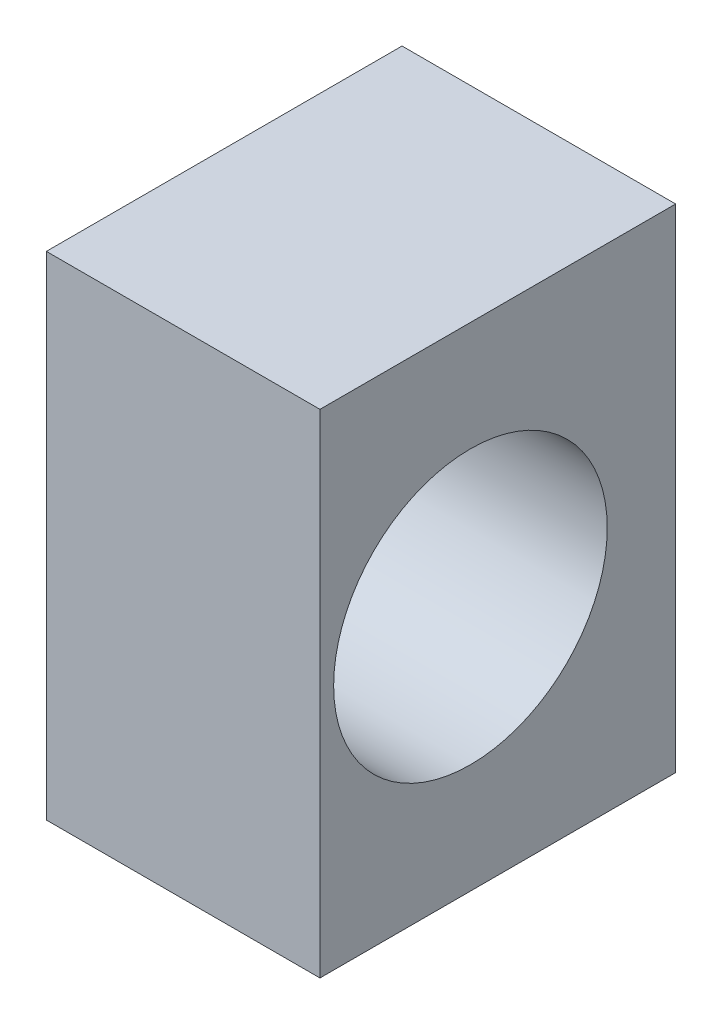
ISO-10303-21;
HEADER;
FILE_DESCRIPTION(('STEP AP214'),'2;1');
FILE_NAME('part.step','',(''),(''),'','','');
FILE_SCHEMA(('AUTOMOTIVE_DESIGN { 1 0 10303 214 1 1 1 1 }'));
ENDSEC;
DATA;
#1=APPLICATION_CONTEXT('core data for automotive mechanical design processes');
#2=APPLICATION_PROTOCOL_DEFINITION('international standard','automotive_design',2000,#1);
#3=PRODUCT_CONTEXT('',#1,'mechanical');
#4=PRODUCT('Part','Part','',(#3));
#5=PRODUCT_RELATED_PRODUCT_CATEGORY('part','',(#4));
#6=PRODUCT_DEFINITION_FORMATION('','',#4);
#7=PRODUCT_DEFINITION_CONTEXT('part definition',#1,'design');
#8=PRODUCT_DEFINITION('design','',#6,#7);
#9=PRODUCT_DEFINITION_SHAPE('','',#8);
#10=(LENGTH_UNIT() NAMED_UNIT(*) SI_UNIT(.MILLI.,.METRE.));
#11=(NAMED_UNIT(*) PLANE_ANGLE_UNIT() SI_UNIT($,.RADIAN.));
#12=(NAMED_UNIT(*) SI_UNIT($,.STERADIAN.) SOLID_ANGLE_UNIT());
#13=UNCERTAINTY_MEASURE_WITH_UNIT(LENGTH_MEASURE(1.E-05),#10,'distance_accuracy_value','');
#14=(GEOMETRIC_REPRESENTATION_CONTEXT(3) GLOBAL_UNCERTAINTY_ASSIGNED_CONTEXT((#13)) GLOBAL_UNIT_ASSIGNED_CONTEXT((#10,
#11,#12)) REPRESENTATION_CONTEXT('',''));
#15=CARTESIAN_POINT('',(0.,0.,0.));
#16=DIRECTION('',(0.,0.,1.));
#17=DIRECTION('',(1.,0.,0.));
#18=AXIS2_PLACEMENT_3D('',#15,#16,#17);
#19=CARTESIAN_POINT('',(10.,0.,0.));
#20=DIRECTION('',(0.,0.,-1.));
#21=DIRECTION('',(0.,1.,0.));
#22=AXIS2_PLACEMENT_3D('',#19,#20,#21);
#23=PLANE('',#22);
#24=DIRECTION('',(0.,-1.,0.));
#25=VECTOR('',#24,1.);
#26=CARTESIAN_POINT('',(0.,0.,0.));
#27=LINE('',#26,#25);
#28=CARTESIAN_POINT('',(0.,18.,0.));
#29=VERTEX_POINT('',#28);
#30=CARTESIAN_POINT('',(0.,0.,0.));
#31=VERTEX_POINT('',#30);
#32=EDGE_CURVE('E94',#29,#31,#27,.T.);
#33=ORIENTED_EDGE('',*,*,#32,.T.);
#34=DIRECTION('',(-1.,0.,0.));
#35=VECTOR('',#34,1.);
#36=CARTESIAN_POINT('',(10.,0.,0.));
#37=LINE('',#36,#35);
#38=CARTESIAN_POINT('',(10.,0.,0.));
#39=VERTEX_POINT('',#38);
#40=EDGE_CURVE('E11',#39,#31,#37,.T.);
#41=ORIENTED_EDGE('',*,*,#40,.F.);
#42=DIRECTION('',(0.,-1.,0.));
#43=VECTOR('',#42,1.);
#44=CARTESIAN_POINT('',(10.,0.,0.));
#45=LINE('',#44,#43);
#46=CARTESIAN_POINT('',(10.,18.,0.));
#47=VERTEX_POINT('',#46);
#48=EDGE_CURVE('E82',#47,#39,#45,.T.);
#49=ORIENTED_EDGE('',*,*,#48,.F.);
#50=DIRECTION('',(-1.,0.,0.));
#51=VECTOR('',#50,1.);
#52=CARTESIAN_POINT('',(10.,18.,0.));
#53=LINE('',#52,#51);
#54=EDGE_CURVE('E90',#47,#29,#53,.T.);
#55=ORIENTED_EDGE('',*,*,#54,.T.);
#56=EDGE_LOOP('',(#33,#41,#49,#55));
#57=FACE_BOUND('',#56,.T.);
#58=ADVANCED_FACE('F31',(#57),#23,.F.);
#59=CARTESIAN_POINT('',(10.,0.,0.));
#60=DIRECTION('',(0.,1.,0.));
#61=DIRECTION('',(0.,0.,1.));
#62=AXIS2_PLACEMENT_3D('',#59,#60,#61);
#63=PLANE('',#62);
#64=DIRECTION('',(0.,0.,-1.));
#65=VECTOR('',#64,1.);
#66=CARTESIAN_POINT('',(0.,0.,0.));
#67=LINE('',#66,#65);
#68=CARTESIAN_POINT('',(0.,0.,-13.));
#69=VERTEX_POINT('',#68);
#70=EDGE_CURVE('E86',#31,#69,#67,.T.);
#71=ORIENTED_EDGE('',*,*,#70,.T.);
#72=DIRECTION('',(-1.,0.,0.));
#73=VECTOR('',#72,1.);
#74=CARTESIAN_POINT('',(10.,0.,-13.));
#75=LINE('',#74,#73);
#76=CARTESIAN_POINT('',(10.,0.,-13.));
#77=VERTEX_POINT('',#76);
#78=EDGE_CURVE('E39',#77,#69,#75,.T.);
#79=ORIENTED_EDGE('',*,*,#78,.F.);
#80=DIRECTION('',(0.,0.,-1.));
#81=VECTOR('',#80,1.);
#82=CARTESIAN_POINT('',(10.,0.,0.));
#83=LINE('',#82,#81);
#84=EDGE_CURVE('E77',#39,#77,#83,.T.);
#85=ORIENTED_EDGE('',*,*,#84,.F.);
#86=ORIENTED_EDGE('',*,*,#40,.T.);
#87=EDGE_LOOP('',(#71,#79,#85,#86));
#88=FACE_BOUND('',#87,.T.);
#89=ADVANCED_FACE('F85',(#88),#63,.F.);
#90=CARTESIAN_POINT('',(10.,0.,-13.));
#91=DIRECTION('',(0.,0.,1.));
#92=DIRECTION('',(0.,-1.,0.));
#93=AXIS2_PLACEMENT_3D('',#90,#91,#92);
#94=PLANE('',#93);
#95=DIRECTION('',(0.,1.,0.));
#96=VECTOR('',#95,1.);
#97=CARTESIAN_POINT('',(0.,0.,-13.));
#98=LINE('',#97,#96);
#99=CARTESIAN_POINT('',(0.,18.,-13.));
#100=VERTEX_POINT('',#99);
#101=EDGE_CURVE('E64',#69,#100,#98,.T.);
#102=ORIENTED_EDGE('',*,*,#101,.T.);
#103=DIRECTION('',(-1.,0.,0.));
#104=VECTOR('',#103,1.);
#105=CARTESIAN_POINT('',(10.,18.,-13.));
#106=LINE('',#105,#104);
#107=CARTESIAN_POINT('',(10.,18.,-13.));
#108=VERTEX_POINT('',#107);
#109=EDGE_CURVE('E87',#108,#100,#106,.T.);
#110=ORIENTED_EDGE('',*,*,#109,.F.);
#111=DIRECTION('',(0.,1.,0.));
#112=VECTOR('',#111,1.);
#113=CARTESIAN_POINT('',(10.,0.,-13.));
#114=LINE('',#113,#112);
#115=EDGE_CURVE('E80',#77,#108,#114,.T.);
#116=ORIENTED_EDGE('',*,*,#115,.F.);
#117=ORIENTED_EDGE('',*,*,#78,.T.);
#118=EDGE_LOOP('',(#102,#110,#116,#117));
#119=FACE_BOUND('',#118,.T.);
#120=ADVANCED_FACE('F88',(#119),#94,.F.);
#121=CARTESIAN_POINT('',(10.,18.,0.));
#122=DIRECTION('',(0.,-1.,0.));
#123=DIRECTION('',(0.,0.,-1.));
#124=AXIS2_PLACEMENT_3D('',#121,#122,#123);
#125=PLANE('',#124);
#126=DIRECTION('',(0.,0.,1.));
#127=VECTOR('',#126,1.);
#128=CARTESIAN_POINT('',(0.,18.,0.));
#129=LINE('',#128,#127);
#130=EDGE_CURVE('E70',#100,#29,#129,.T.);
#131=ORIENTED_EDGE('',*,*,#130,.T.);
#132=ORIENTED_EDGE('',*,*,#54,.F.);
#133=DIRECTION('',(0.,0.,1.));
#134=VECTOR('',#133,1.);
#135=CARTESIAN_POINT('',(10.,18.,0.));
#136=LINE('',#135,#134);
#137=EDGE_CURVE('E47',#108,#47,#136,.T.);
#138=ORIENTED_EDGE('',*,*,#137,.F.);
#139=ORIENTED_EDGE('',*,*,#109,.T.);
#140=EDGE_LOOP('',(#131,#132,#138,#139));
#141=FACE_BOUND('',#140,.T.);
#142=ADVANCED_FACE('F102',(#141),#125,.F.);
#143=CARTESIAN_POINT('',(10.,18.,0.));
#144=DIRECTION('',(-1.,0.,0.));
#145=DIRECTION('',(0.,0.,1.));
#146=AXIS2_PLACEMENT_3D('',#143,#144,#145);
#147=PLANE('',#146);
#148=CARTESIAN_POINT('',(10.,9.,-5.5));
#149=DIRECTION('',(-1.,0.,0.));
#150=DIRECTION('',(0.,0.,1.));
#151=AXIS2_PLACEMENT_3D('',#148,#149,#150);
#152=CIRCLE('',#151,5.);
#153=CARTESIAN_POINT('',(10.,9.,-0.499999999999993));
#154=VERTEX_POINT('',#153);
#155=EDGE_CURVE('E97',#154,#154,#152,.T.);
#156=ORIENTED_EDGE('',*,*,#155,.T.);
#157=EDGE_LOOP('',(#156));
#158=FACE_BOUND('',#157,.T.);
#159=ORIENTED_EDGE('',*,*,#48,.T.);
#160=ORIENTED_EDGE('',*,*,#84,.T.);
#161=ORIENTED_EDGE('',*,*,#115,.T.);
#162=ORIENTED_EDGE('',*,*,#137,.T.);
#163=EDGE_LOOP('',(#159,#160,#161,#162));
#164=FACE_BOUND('',#163,.T.);
#165=ADVANCED_FACE('F78',(#158,#164),#147,.F.);
#166=CARTESIAN_POINT('',(0.,18.,0.));
#167=DIRECTION('',(-1.,0.,0.));
#168=DIRECTION('',(0.,0.,1.));
#169=AXIS2_PLACEMENT_3D('',#166,#167,#168);
#170=PLANE('',#169);
#171=CARTESIAN_POINT('',(0.,9.,-5.5));
#172=DIRECTION('',(-1.,0.,0.));
#173=DIRECTION('',(0.,0.,1.));
#174=AXIS2_PLACEMENT_3D('',#171,#172,#173);
#175=CIRCLE('',#174,5.);
#176=CARTESIAN_POINT('',(0.,9.,-0.499999999999993));
#177=VERTEX_POINT('',#176);
#178=EDGE_CURVE('E108',#177,#177,#175,.T.);
#179=ORIENTED_EDGE('',*,*,#178,.F.);
#180=EDGE_LOOP('',(#179));
#181=FACE_BOUND('',#180,.T.);
#182=ORIENTED_EDGE('',*,*,#32,.F.);
#183=ORIENTED_EDGE('',*,*,#130,.F.);
#184=ORIENTED_EDGE('',*,*,#101,.F.);
#185=ORIENTED_EDGE('',*,*,#70,.F.);
#186=EDGE_LOOP('',(#182,#183,#184,#185));
#187=FACE_BOUND('',#186,.T.);
#188=ADVANCED_FACE('F105',(#181,#187),#170,.T.);
#189=CARTESIAN_POINT('',(10.,9.,-5.5));
#190=DIRECTION('',(-1.,0.,0.));
#191=DIRECTION('',(0.,0.,1.));
#192=AXIS2_PLACEMENT_3D('',#189,#190,#191);
#193=CYLINDRICAL_SURFACE('',#192,5.);
#194=ORIENTED_EDGE('',*,*,#155,.F.);
#195=EDGE_LOOP('',(#194));
#196=FACE_BOUND('',#195,.T.);
#197=ORIENTED_EDGE('',*,*,#178,.T.);
#198=EDGE_LOOP('',(#197));
#199=FACE_BOUND('',#198,.T.);
#200=ADVANCED_FACE('F115',(#196,#199),#193,.F.);
#201=CLOSED_SHELL('',(#58,#89,#120,#142,#165,#188,#200));
#202=MANIFOLD_SOLID_BREP('B2',#201);
#203=ADVANCED_BREP_SHAPE_REPRESENTATION('',(#18,#202),#14);
#204=SHAPE_DEFINITION_REPRESENTATION(#9,#203);
ENDSEC;
END-ISO-10303-21;
